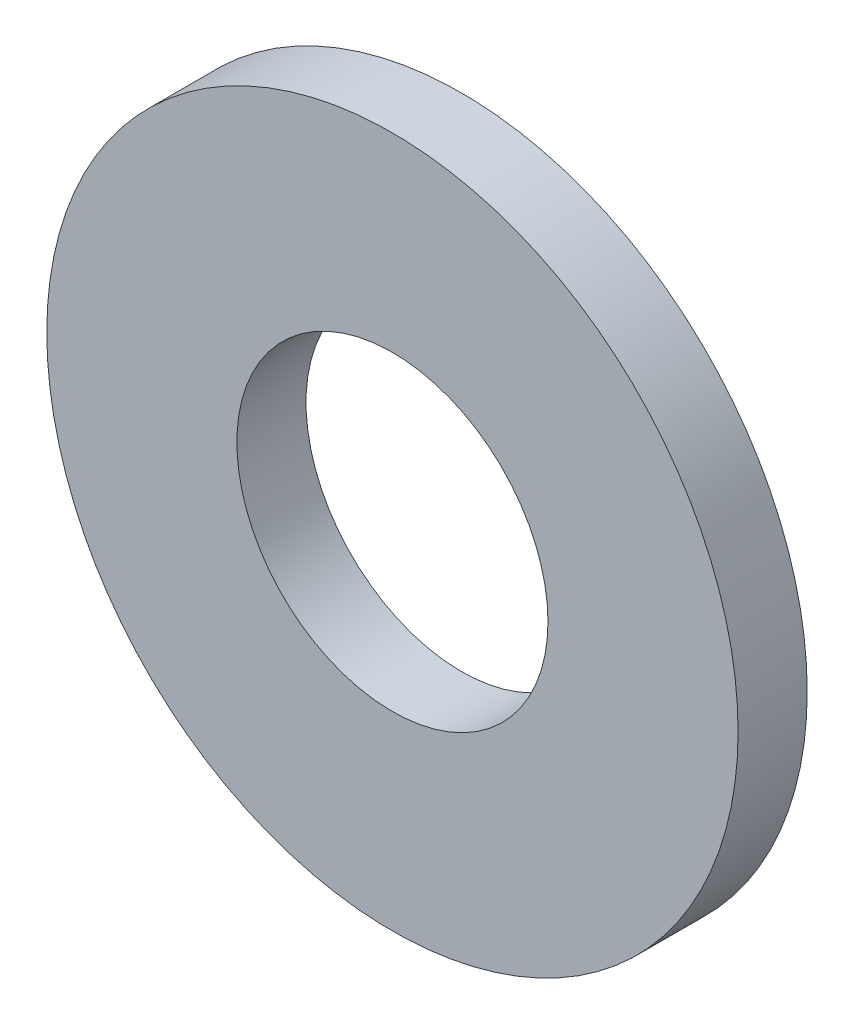
ISO-10303-21;
HEADER;
FILE_DESCRIPTION(('STEP AP214'),'2;1');
FILE_NAME('part.step','',(''),(''),'','','');
FILE_SCHEMA(('AUTOMOTIVE_DESIGN { 1 0 10303 214 1 1 1 1 }'));
ENDSEC;
DATA;
#1=APPLICATION_CONTEXT('core data for automotive mechanical design processes');
#2=APPLICATION_PROTOCOL_DEFINITION('international standard','automotive_design',2000,#1);
#3=PRODUCT_CONTEXT('',#1,'mechanical');
#4=PRODUCT('Part','Part','',(#3));
#5=PRODUCT_RELATED_PRODUCT_CATEGORY('part','',(#4));
#6=PRODUCT_DEFINITION_FORMATION('','',#4);
#7=PRODUCT_DEFINITION_CONTEXT('part definition',#1,'design');
#8=PRODUCT_DEFINITION('design','',#6,#7);
#9=PRODUCT_DEFINITION_SHAPE('','',#8);
#10=(LENGTH_UNIT() NAMED_UNIT(*) SI_UNIT(.MILLI.,.METRE.));
#11=(NAMED_UNIT(*) PLANE_ANGLE_UNIT() SI_UNIT($,.RADIAN.));
#12=(NAMED_UNIT(*) SI_UNIT($,.STERADIAN.) SOLID_ANGLE_UNIT());
#13=UNCERTAINTY_MEASURE_WITH_UNIT(LENGTH_MEASURE(1.E-05),#10,'distance_accuracy_value','');
#14=(GEOMETRIC_REPRESENTATION_CONTEXT(3) GLOBAL_UNCERTAINTY_ASSIGNED_CONTEXT((#13)) GLOBAL_UNIT_ASSIGNED_CONTEXT((#10,
#11,#12)) REPRESENTATION_CONTEXT('',''));
#15=CARTESIAN_POINT('',(0.,0.,0.));
#16=DIRECTION('',(0.,0.,1.));
#17=DIRECTION('',(1.,0.,0.));
#18=AXIS2_PLACEMENT_3D('',#15,#16,#17);
#19=CARTESIAN_POINT('',(0.,0.,0.6));
#20=DIRECTION('',(0.,0.,1.));
#21=DIRECTION('',(1.,0.,0.));
#22=AXIS2_PLACEMENT_3D('',#19,#20,#21);
#23=PLANE('',#22);
#24=CARTESIAN_POINT('',(0.,0.,0.6));
#25=DIRECTION('',(0.,0.,1.));
#26=DIRECTION('',(1.,0.,0.));
#27=AXIS2_PLACEMENT_3D('',#24,#25,#26);
#28=CIRCLE('',#27,3.);
#29=CARTESIAN_POINT('',(3.,0.,0.6));
#30=VERTEX_POINT('',#29);
#31=EDGE_CURVE('E10',#30,#30,#28,.T.);
#32=ORIENTED_EDGE('',*,*,#31,.T.);
#33=EDGE_LOOP('',(#32));
#34=FACE_BOUND('',#33,.T.);
#35=CARTESIAN_POINT('',(0.,0.,0.6));
#36=DIRECTION('',(0.,0.,1.));
#37=DIRECTION('',(1.,0.,0.));
#38=AXIS2_PLACEMENT_3D('',#35,#36,#37);
#39=CIRCLE('',#38,1.35);
#40=CARTESIAN_POINT('',(1.35,0.,0.6));
#41=VERTEX_POINT('',#40);
#42=EDGE_CURVE('E48',#41,#41,#39,.T.);
#43=ORIENTED_EDGE('',*,*,#42,.F.);
#44=EDGE_LOOP('',(#43));
#45=FACE_BOUND('',#44,.T.);
#46=ADVANCED_FACE('F37',(#34,#45),#23,.T.);
#47=CARTESIAN_POINT('',(0.,0.,0.));
#48=DIRECTION('',(0.,0.,1.));
#49=DIRECTION('',(1.,0.,0.));
#50=AXIS2_PLACEMENT_3D('',#47,#48,#49);
#51=PLANE('',#50);
#52=CARTESIAN_POINT('',(0.,0.,0.));
#53=DIRECTION('',(0.,0.,1.));
#54=DIRECTION('',(1.,0.,0.));
#55=AXIS2_PLACEMENT_3D('',#52,#53,#54);
#56=CIRCLE('',#55,3.);
#57=CARTESIAN_POINT('',(3.,0.,0.));
#58=VERTEX_POINT('',#57);
#59=EDGE_CURVE('E41',#58,#58,#56,.T.);
#60=ORIENTED_EDGE('',*,*,#59,.F.);
#61=EDGE_LOOP('',(#60));
#62=FACE_BOUND('',#61,.T.);
#63=CARTESIAN_POINT('',(0.,0.,0.));
#64=DIRECTION('',(0.,0.,1.));
#65=DIRECTION('',(1.,0.,0.));
#66=AXIS2_PLACEMENT_3D('',#63,#64,#65);
#67=CIRCLE('',#66,1.35);
#68=CARTESIAN_POINT('',(1.35,0.,0.));
#69=VERTEX_POINT('',#68);
#70=EDGE_CURVE('E50',#69,#69,#67,.T.);
#71=ORIENTED_EDGE('',*,*,#70,.T.);
#72=EDGE_LOOP('',(#71));
#73=FACE_BOUND('',#72,.T.);
#74=ADVANCED_FACE('F60',(#62,#73),#51,.F.);
#75=CARTESIAN_POINT('',(0.,0.,0.6));
#76=DIRECTION('',(0.,0.,-1.));
#77=DIRECTION('',(-1.,0.,0.));
#78=AXIS2_PLACEMENT_3D('',#75,#76,#77);
#79=CYLINDRICAL_SURFACE('',#78,3.);
#80=ORIENTED_EDGE('',*,*,#31,.F.);
#81=EDGE_LOOP('',(#80));
#82=FACE_BOUND('',#81,.T.);
#83=ORIENTED_EDGE('',*,*,#59,.T.);
#84=EDGE_LOOP('',(#83));
#85=FACE_BOUND('',#84,.T.);
#86=ADVANCED_FACE('F39',(#82,#85),#79,.T.);
#87=CARTESIAN_POINT('',(0.,0.,0.6));
#88=DIRECTION('',(0.,0.,-1.));
#89=DIRECTION('',(-1.,0.,0.));
#90=AXIS2_PLACEMENT_3D('',#87,#88,#89);
#91=CYLINDRICAL_SURFACE('',#90,1.35);
#92=ORIENTED_EDGE('',*,*,#42,.T.);
#93=EDGE_LOOP('',(#92));
#94=FACE_BOUND('',#93,.T.);
#95=ORIENTED_EDGE('',*,*,#70,.F.);
#96=EDGE_LOOP('',(#95));
#97=FACE_BOUND('',#96,.T.);
#98=ADVANCED_FACE('F56',(#94,#97),#91,.F.);
#99=CLOSED_SHELL('',(#46,#74,#86,#98));
#100=MANIFOLD_SOLID_BREP('B2',#99);
#101=ADVANCED_BREP_SHAPE_REPRESENTATION('',(#18,#100),#14);
#102=SHAPE_DEFINITION_REPRESENTATION(#9,#101);
ENDSEC;
END-ISO-10303-21;
